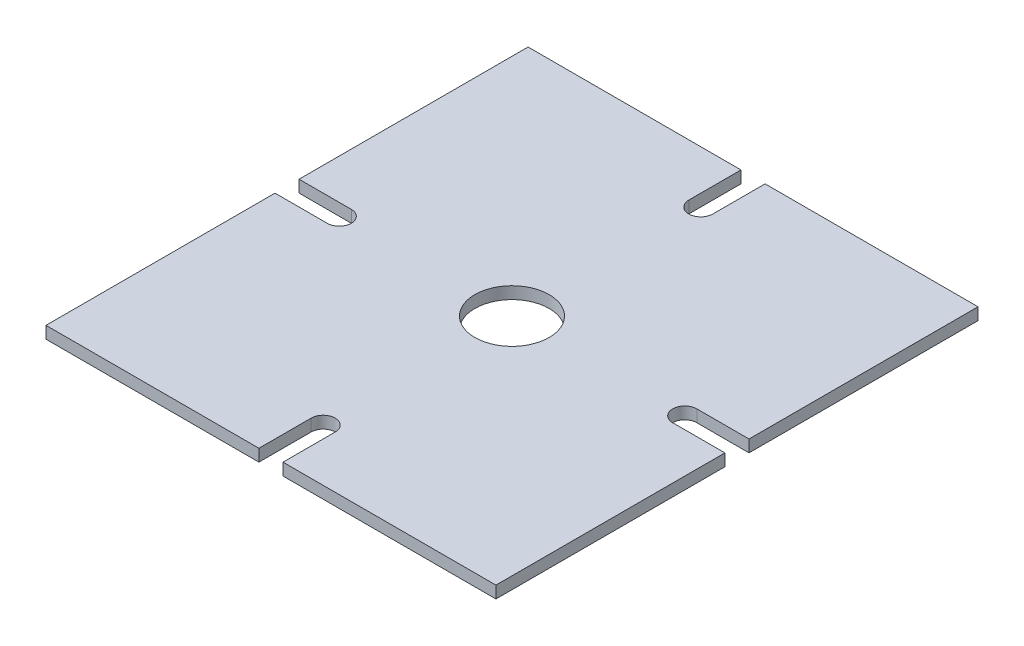
ISO-10303-21;
HEADER;
FILE_DESCRIPTION(('STEP AP214'),'2;1');
FILE_NAME('part.step','',(''),(''),'','','');
FILE_SCHEMA(('AUTOMOTIVE_DESIGN { 1 0 10303 214 1 1 1 1 }'));
ENDSEC;
DATA;
#1=APPLICATION_CONTEXT('core data for automotive mechanical design processes');
#2=APPLICATION_PROTOCOL_DEFINITION('international standard','automotive_design',2000,#1);
#3=PRODUCT_CONTEXT('',#1,'mechanical');
#4=PRODUCT('Part','Part','',(#3));
#5=PRODUCT_RELATED_PRODUCT_CATEGORY('part','',(#4));
#6=PRODUCT_DEFINITION_FORMATION('','',#4);
#7=PRODUCT_DEFINITION_CONTEXT('part definition',#1,'design');
#8=PRODUCT_DEFINITION('design','',#6,#7);
#9=PRODUCT_DEFINITION_SHAPE('','',#8);
#10=(LENGTH_UNIT() NAMED_UNIT(*) SI_UNIT(.MILLI.,.METRE.));
#11=(NAMED_UNIT(*) PLANE_ANGLE_UNIT() SI_UNIT($,.RADIAN.));
#12=(NAMED_UNIT(*) SI_UNIT($,.STERADIAN.) SOLID_ANGLE_UNIT());
#13=UNCERTAINTY_MEASURE_WITH_UNIT(LENGTH_MEASURE(1.E-05),#10,'distance_accuracy_value','');
#14=(GEOMETRIC_REPRESENTATION_CONTEXT(3) GLOBAL_UNCERTAINTY_ASSIGNED_CONTEXT((#13)) GLOBAL_UNIT_ASSIGNED_CONTEXT((#10,
#11,#12)) REPRESENTATION_CONTEXT('',''));
#15=CARTESIAN_POINT('',(0.,0.,0.));
#16=DIRECTION('',(0.,0.,1.));
#17=DIRECTION('',(1.,0.,0.));
#18=AXIS2_PLACEMENT_3D('',#15,#16,#17);
#19=CARTESIAN_POINT('',(56.,3.,60.));
#20=DIRECTION('',(-1.,0.,0.));
#21=DIRECTION('',(0.,0.,1.));
#22=AXIS2_PLACEMENT_3D('',#19,#20,#21);
#23=PLANE('',#22);
#24=DIRECTION('',(0.,0.,-1.));
#25=VECTOR('',#24,1.);
#26=CARTESIAN_POINT('',(56.,0.,60.));
#27=LINE('',#26,#25);
#28=CARTESIAN_POINT('',(56.,0.,60.));
#29=VERTEX_POINT('',#28);
#30=CARTESIAN_POINT('',(56.,0.,3.));
#31=VERTEX_POINT('',#30);
#32=EDGE_CURVE('E271',#29,#31,#27,.T.);
#33=ORIENTED_EDGE('',*,*,#32,.T.);
#34=DIRECTION('',(0.,1.,0.));
#35=VECTOR('',#34,1.);
#36=CARTESIAN_POINT('',(56.,-7.,3.));
#37=LINE('',#36,#35);
#38=CARTESIAN_POINT('',(56.,3.,3.));
#39=VERTEX_POINT('',#38);
#40=EDGE_CURVE('E228',#31,#39,#37,.T.);
#41=ORIENTED_EDGE('',*,*,#40,.T.);
#42=DIRECTION('',(0.,0.,-1.));
#43=VECTOR('',#42,1.);
#44=CARTESIAN_POINT('',(56.,3.,60.));
#45=LINE('',#44,#43);
#46=CARTESIAN_POINT('',(56.,3.,60.));
#47=VERTEX_POINT('',#46);
#48=EDGE_CURVE('E256',#47,#39,#45,.T.);
#49=ORIENTED_EDGE('',*,*,#48,.F.);
#50=DIRECTION('',(0.,-1.,0.));
#51=VECTOR('',#50,1.);
#52=CARTESIAN_POINT('',(56.,3.,60.));
#53=LINE('',#52,#51);
#54=EDGE_CURVE('E270',#47,#29,#53,.T.);
#55=ORIENTED_EDGE('',*,*,#54,.T.);
#56=EDGE_LOOP('',(#33,#41,#49,#55));
#57=FACE_BOUND('',#56,.T.);
#58=ADVANCED_FACE('F37',(#57),#23,.F.);
#59=CARTESIAN_POINT('',(-56.,3.,-60.));
#60=DIRECTION('',(0.,0.,1.));
#61=DIRECTION('',(1.,0.,0.));
#62=AXIS2_PLACEMENT_3D('',#59,#60,#61);
#63=PLANE('',#62);
#64=DIRECTION('',(-1.,0.,0.));
#65=VECTOR('',#64,1.);
#66=CARTESIAN_POINT('',(-56.,3.,-60.));
#67=LINE('',#66,#65);
#68=CARTESIAN_POINT('',(-3.,3.,-60.));
#69=VERTEX_POINT('',#68);
#70=CARTESIAN_POINT('',(-56.,3.,-60.));
#71=VERTEX_POINT('',#70);
#72=EDGE_CURVE('E259',#69,#71,#67,.T.);
#73=ORIENTED_EDGE('',*,*,#72,.F.);
#74=DIRECTION('',(0.,1.,0.));
#75=VECTOR('',#74,1.);
#76=CARTESIAN_POINT('',(-3.,-7.,-60.));
#77=LINE('',#76,#75);
#78=CARTESIAN_POINT('',(-3.,0.,-60.));
#79=VERTEX_POINT('',#78);
#80=EDGE_CURVE('E211',#79,#69,#77,.T.);
#81=ORIENTED_EDGE('',*,*,#80,.F.);
#82=DIRECTION('',(-1.,0.,0.));
#83=VECTOR('',#82,1.);
#84=CARTESIAN_POINT('',(-56.,0.,-60.));
#85=LINE('',#84,#83);
#86=CARTESIAN_POINT('',(-56.,0.,-60.));
#87=VERTEX_POINT('',#86);
#88=EDGE_CURVE('E274',#79,#87,#85,.T.);
#89=ORIENTED_EDGE('',*,*,#88,.T.);
#90=DIRECTION('',(0.,-1.,0.));
#91=VECTOR('',#90,1.);
#92=CARTESIAN_POINT('',(-56.,3.,-60.));
#93=LINE('',#92,#91);
#94=EDGE_CURVE('E292',#71,#87,#93,.T.);
#95=ORIENTED_EDGE('',*,*,#94,.F.);
#96=EDGE_LOOP('',(#73,#81,#89,#95));
#97=FACE_BOUND('',#96,.T.);
#98=ADVANCED_FACE('F370',(#97),#63,.F.);
#99=CARTESIAN_POINT('',(-56.,3.,60.));
#100=DIRECTION('',(1.,0.,0.));
#101=DIRECTION('',(0.,0.,-1.));
#102=AXIS2_PLACEMENT_3D('',#99,#100,#101);
#103=PLANE('',#102);
#104=DIRECTION('',(0.,0.,1.));
#105=VECTOR('',#104,1.);
#106=CARTESIAN_POINT('',(-56.,3.,60.));
#107=LINE('',#106,#105);
#108=CARTESIAN_POINT('',(-56.,3.,3.));
#109=VERTEX_POINT('',#108);
#110=CARTESIAN_POINT('',(-56.,3.,60.));
#111=VERTEX_POINT('',#110);
#112=EDGE_CURVE('E264',#109,#111,#107,.T.);
#113=ORIENTED_EDGE('',*,*,#112,.F.);
#114=DIRECTION('',(0.,1.,0.));
#115=VECTOR('',#114,1.);
#116=CARTESIAN_POINT('',(-56.,-7.,3.));
#117=LINE('',#116,#115);
#118=CARTESIAN_POINT('',(-56.,0.,3.));
#119=VERTEX_POINT('',#118);
#120=EDGE_CURVE('E243',#119,#109,#117,.T.);
#121=ORIENTED_EDGE('',*,*,#120,.F.);
#122=DIRECTION('',(0.,0.,1.));
#123=VECTOR('',#122,1.);
#124=CARTESIAN_POINT('',(-56.,0.,60.));
#125=LINE('',#124,#123);
#126=CARTESIAN_POINT('',(-56.,0.,60.));
#127=VERTEX_POINT('',#126);
#128=EDGE_CURVE('E279',#119,#127,#125,.T.);
#129=ORIENTED_EDGE('',*,*,#128,.T.);
#130=DIRECTION('',(0.,-1.,0.));
#131=VECTOR('',#130,1.);
#132=CARTESIAN_POINT('',(-56.,3.,60.));
#133=LINE('',#132,#131);
#134=EDGE_CURVE('E289',#111,#127,#133,.T.);
#135=ORIENTED_EDGE('',*,*,#134,.F.);
#136=EDGE_LOOP('',(#113,#121,#129,#135));
#137=FACE_BOUND('',#136,.T.);
#138=ADVANCED_FACE('F394',(#137),#103,.F.);
#139=CARTESIAN_POINT('',(-56.,3.,60.));
#140=DIRECTION('',(0.,0.,-1.));
#141=DIRECTION('',(-1.,0.,0.));
#142=AXIS2_PLACEMENT_3D('',#139,#140,#141);
#143=PLANE('',#142);
#144=DIRECTION('',(1.,0.,0.));
#145=VECTOR('',#144,1.);
#146=CARTESIAN_POINT('',(-56.,3.,60.));
#147=LINE('',#146,#145);
#148=CARTESIAN_POINT('',(3.00000000000004,3.,60.));
#149=VERTEX_POINT('',#148);
#150=EDGE_CURVE('E268',#149,#47,#147,.T.);
#151=ORIENTED_EDGE('',*,*,#150,.F.);
#152=DIRECTION('',(0.,1.,0.));
#153=VECTOR('',#152,1.);
#154=CARTESIAN_POINT('',(3.00000000000004,-7.,60.));
#155=LINE('',#154,#153);
#156=CARTESIAN_POINT('',(3.00000000000004,0.,60.));
#157=VERTEX_POINT('',#156);
#158=EDGE_CURVE('E204',#157,#149,#155,.T.);
#159=ORIENTED_EDGE('',*,*,#158,.F.);
#160=DIRECTION('',(1.,0.,0.));
#161=VECTOR('',#160,1.);
#162=CARTESIAN_POINT('',(-56.,0.,60.));
#163=LINE('',#162,#161);
#164=EDGE_CURVE('E283',#157,#29,#163,.T.);
#165=ORIENTED_EDGE('',*,*,#164,.T.);
#166=ORIENTED_EDGE('',*,*,#54,.F.);
#167=EDGE_LOOP('',(#151,#159,#165,#166));
#168=FACE_BOUND('',#167,.T.);
#169=ADVANCED_FACE('F331',(#168),#143,.F.);
#170=CARTESIAN_POINT('',(56.,3.,-3.));
#171=VERTEX_POINT('',#170);
#172=CARTESIAN_POINT('',(56.,3.,-60.));
#173=VERTEX_POINT('',#172);
#174=EDGE_CURVE('E260',#171,#173,#45,.T.);
#175=ORIENTED_EDGE('',*,*,#174,.F.);
#176=DIRECTION('',(0.,1.,0.));
#177=VECTOR('',#176,1.);
#178=CARTESIAN_POINT('',(56.,-7.,-3.));
#179=LINE('',#178,#177);
#180=CARTESIAN_POINT('',(56.,0.,-3.));
#181=VERTEX_POINT('',#180);
#182=EDGE_CURVE('E222',#181,#171,#179,.T.);
#183=ORIENTED_EDGE('',*,*,#182,.F.);
#184=CARTESIAN_POINT('',(56.,0.,-60.));
#185=VERTEX_POINT('',#184);
#186=EDGE_CURVE('E275',#181,#185,#27,.T.);
#187=ORIENTED_EDGE('',*,*,#186,.T.);
#188=DIRECTION('',(0.,-1.,0.));
#189=VECTOR('',#188,1.);
#190=CARTESIAN_POINT('',(56.,3.,-60.));
#191=LINE('',#190,#189);
#192=EDGE_CURVE('E295',#173,#185,#191,.T.);
#193=ORIENTED_EDGE('',*,*,#192,.F.);
#194=EDGE_LOOP('',(#175,#183,#187,#193));
#195=FACE_BOUND('',#194,.T.);
#196=ADVANCED_FACE('F39',(#195),#23,.F.);
#197=CARTESIAN_POINT('',(3.00000000000002,0.,-60.));
#198=VERTEX_POINT('',#197);
#199=EDGE_CURVE('E276',#185,#198,#85,.T.);
#200=ORIENTED_EDGE('',*,*,#199,.T.);
#201=DIRECTION('',(0.,1.,0.));
#202=VECTOR('',#201,1.);
#203=CARTESIAN_POINT('',(3.00000000000004,-7.,-60.));
#204=LINE('',#203,#202);
#205=CARTESIAN_POINT('',(3.00000000000004,3.,-60.));
#206=VERTEX_POINT('',#205);
#207=EDGE_CURVE('E60',#198,#206,#204,.T.);
#208=ORIENTED_EDGE('',*,*,#207,.T.);
#209=EDGE_CURVE('E261',#173,#206,#67,.T.);
#210=ORIENTED_EDGE('',*,*,#209,.F.);
#211=ORIENTED_EDGE('',*,*,#192,.T.);
#212=EDGE_LOOP('',(#200,#208,#210,#211));
#213=FACE_BOUND('',#212,.T.);
#214=ADVANCED_FACE('F353',(#213),#63,.F.);
#215=CARTESIAN_POINT('',(-56.,0.,-3.));
#216=VERTEX_POINT('',#215);
#217=EDGE_CURVE('E280',#87,#216,#125,.T.);
#218=ORIENTED_EDGE('',*,*,#217,.T.);
#219=DIRECTION('',(0.,1.,0.));
#220=VECTOR('',#219,1.);
#221=CARTESIAN_POINT('',(-56.,-7.,-3.));
#222=LINE('',#221,#220);
#223=CARTESIAN_POINT('',(-56.,3.,-3.));
#224=VERTEX_POINT('',#223);
#225=EDGE_CURVE('E240',#216,#224,#222,.T.);
#226=ORIENTED_EDGE('',*,*,#225,.T.);
#227=EDGE_CURVE('E265',#71,#224,#107,.T.);
#228=ORIENTED_EDGE('',*,*,#227,.F.);
#229=ORIENTED_EDGE('',*,*,#94,.T.);
#230=EDGE_LOOP('',(#218,#226,#228,#229));
#231=FACE_BOUND('',#230,.T.);
#232=ADVANCED_FACE('F375',(#231),#103,.F.);
#233=CARTESIAN_POINT('',(-3.,0.,60.));
#234=VERTEX_POINT('',#233);
#235=EDGE_CURVE('E284',#127,#234,#163,.T.);
#236=ORIENTED_EDGE('',*,*,#235,.T.);
#237=DIRECTION('',(0.,1.,0.));
#238=VECTOR('',#237,1.);
#239=CARTESIAN_POINT('',(-3.,-7.,60.));
#240=LINE('',#239,#238);
#241=CARTESIAN_POINT('',(-3.,3.,60.));
#242=VERTEX_POINT('',#241);
#243=EDGE_CURVE('E182',#234,#242,#240,.T.);
#244=ORIENTED_EDGE('',*,*,#243,.T.);
#245=EDGE_CURVE('E198',#111,#242,#147,.T.);
#246=ORIENTED_EDGE('',*,*,#245,.F.);
#247=ORIENTED_EDGE('',*,*,#134,.T.);
#248=EDGE_LOOP('',(#236,#244,#246,#247));
#249=FACE_BOUND('',#248,.T.);
#250=ADVANCED_FACE('F398',(#249),#143,.F.);
#251=CARTESIAN_POINT('',(0.,3.,0.));
#252=DIRECTION('',(0.,-1.,0.));
#253=DIRECTION('',(0.,0.,-1.));
#254=AXIS2_PLACEMENT_3D('',#251,#252,#253);
#255=PLANE('',#254);
#256=CARTESIAN_POINT('',(0.,3.,0.));
#257=DIRECTION('',(0.,1.,0.));
#258=DIRECTION('',(0.,0.,1.));
#259=AXIS2_PLACEMENT_3D('',#256,#257,#258);
#260=CIRCLE('',#259,9.25);
#261=CARTESIAN_POINT('',(0.,3.,9.25));
#262=VERTEX_POINT('',#261);
#263=EDGE_CURVE('E203',#262,#262,#260,.T.);
#264=ORIENTED_EDGE('',*,*,#263,.F.);
#265=EDGE_LOOP('',(#264));
#266=FACE_BOUND('',#265,.T.);
#267=CARTESIAN_POINT('',(0.,3.,47.));
#268=DIRECTION('',(0.,1.,0.));
#269=DIRECTION('',(0.,0.,-1.));
#270=AXIS2_PLACEMENT_3D('',#267,#268,#269);
#271=CIRCLE('',#270,3.00000000000001);
#272=CARTESIAN_POINT('',(3.00000000000001,3.,47.));
#273=VERTEX_POINT('',#272);
#274=CARTESIAN_POINT('',(-3.,3.,47.));
#275=VERTEX_POINT('',#274);
#276=EDGE_CURVE('E186',#273,#275,#271,.T.);
#277=ORIENTED_EDGE('',*,*,#276,.F.);
#278=DIRECTION('',(0.,0.,-1.));
#279=VECTOR('',#278,1.);
#280=CARTESIAN_POINT('',(3.00000000000001,3.,47.));
#281=LINE('',#280,#279);
#282=EDGE_CURVE('E183',#149,#273,#281,.T.);
#283=ORIENTED_EDGE('',*,*,#282,.F.);
#284=ORIENTED_EDGE('',*,*,#150,.T.);
#285=ORIENTED_EDGE('',*,*,#48,.T.);
#286=DIRECTION('',(1.,0.,0.));
#287=VECTOR('',#286,1.);
#288=CARTESIAN_POINT('',(43.,3.,3.));
#289=LINE('',#288,#287);
#290=CARTESIAN_POINT('',(43.,3.,3.));
#291=VERTEX_POINT('',#290);
#292=EDGE_CURVE('E224',#291,#39,#289,.T.);
#293=ORIENTED_EDGE('',*,*,#292,.F.);
#294=CARTESIAN_POINT('',(43.,3.,0.));
#295=DIRECTION('',(0.,1.,0.));
#296=DIRECTION('',(0.,0.,1.));
#297=AXIS2_PLACEMENT_3D('',#294,#295,#296);
#298=CIRCLE('',#297,3.);
#299=CARTESIAN_POINT('',(43.,3.,-3.));
#300=VERTEX_POINT('',#299);
#301=EDGE_CURVE('E233',#300,#291,#298,.T.);
#302=ORIENTED_EDGE('',*,*,#301,.F.);
#303=DIRECTION('',(-1.,0.,0.));
#304=VECTOR('',#303,1.);
#305=CARTESIAN_POINT('',(56.,3.,-3.));
#306=LINE('',#305,#304);
#307=EDGE_CURVE('E215',#171,#300,#306,.T.);
#308=ORIENTED_EDGE('',*,*,#307,.F.);
#309=ORIENTED_EDGE('',*,*,#174,.T.);
#310=ORIENTED_EDGE('',*,*,#209,.T.);
#311=DIRECTION('',(0.,0.,-1.));
#312=VECTOR('',#311,1.);
#313=CARTESIAN_POINT('',(3.00000000000001,3.,-47.));
#314=LINE('',#313,#312);
#315=CARTESIAN_POINT('',(3.00000000000001,3.,-47.));
#316=VERTEX_POINT('',#315);
#317=EDGE_CURVE('E218',#316,#206,#314,.T.);
#318=ORIENTED_EDGE('',*,*,#317,.F.);
#319=CARTESIAN_POINT('',(0.,3.,-47.));
#320=DIRECTION('',(0.,1.,0.));
#321=DIRECTION('',(0.,0.,1.));
#322=AXIS2_PLACEMENT_3D('',#319,#320,#321);
#323=CIRCLE('',#322,3.00000000000001);
#324=CARTESIAN_POINT('',(-3.,3.,-47.));
#325=VERTEX_POINT('',#324);
#326=EDGE_CURVE('E193',#325,#316,#323,.T.);
#327=ORIENTED_EDGE('',*,*,#326,.F.);
#328=DIRECTION('',(0.,0.,1.));
#329=VECTOR('',#328,1.);
#330=CARTESIAN_POINT('',(-3.,3.,-60.));
#331=LINE('',#330,#329);
#332=EDGE_CURVE('E209',#69,#325,#331,.T.);
#333=ORIENTED_EDGE('',*,*,#332,.F.);
#334=ORIENTED_EDGE('',*,*,#72,.T.);
#335=ORIENTED_EDGE('',*,*,#227,.T.);
#336=DIRECTION('',(-1.,0.,0.));
#337=VECTOR('',#336,1.);
#338=CARTESIAN_POINT('',(-56.,3.,-3.));
#339=LINE('',#338,#337);
#340=CARTESIAN_POINT('',(-43.,3.,-3.));
#341=VERTEX_POINT('',#340);
#342=EDGE_CURVE('E249',#341,#224,#339,.T.);
#343=ORIENTED_EDGE('',*,*,#342,.F.);
#344=CARTESIAN_POINT('',(-43.,3.,0.));
#345=DIRECTION('',(0.,1.,0.));
#346=DIRECTION('',(0.,0.,-1.));
#347=AXIS2_PLACEMENT_3D('',#344,#345,#346);
#348=CIRCLE('',#347,3.);
#349=CARTESIAN_POINT('',(-43.,3.,3.));
#350=VERTEX_POINT('',#349);
#351=EDGE_CURVE('E231',#350,#341,#348,.T.);
#352=ORIENTED_EDGE('',*,*,#351,.F.);
#353=DIRECTION('',(1.,0.,0.));
#354=VECTOR('',#353,1.);
#355=CARTESIAN_POINT('',(-43.,3.,3.));
#356=LINE('',#355,#354);
#357=EDGE_CURVE('E239',#109,#350,#356,.T.);
#358=ORIENTED_EDGE('',*,*,#357,.F.);
#359=ORIENTED_EDGE('',*,*,#112,.T.);
#360=ORIENTED_EDGE('',*,*,#245,.T.);
#361=DIRECTION('',(0.,0.,1.));
#362=VECTOR('',#361,1.);
#363=CARTESIAN_POINT('',(-3.,3.,60.));
#364=LINE('',#363,#362);
#365=EDGE_CURVE('E176',#275,#242,#364,.T.);
#366=ORIENTED_EDGE('',*,*,#365,.F.);
#367=EDGE_LOOP('',(#277,#283,#284,#285,#293,#302,#308,#309,#310,#318,#327,#333,#334,#335,#343,
#352,#358,#359,#360,#366));
#368=FACE_BOUND('',#367,.T.);
#369=ADVANCED_FACE('F196',(#266,#368),#255,.F.);
#370=CARTESIAN_POINT('',(0.,0.,0.));
#371=DIRECTION('',(0.,-1.,0.));
#372=DIRECTION('',(0.,0.,-1.));
#373=AXIS2_PLACEMENT_3D('',#370,#371,#372);
#374=PLANE('',#373);
#375=DIRECTION('',(0.,0.,1.));
#376=VECTOR('',#375,1.);
#377=CARTESIAN_POINT('',(2.99999999999993,0.,0.));
#378=LINE('',#377,#376);
#379=CARTESIAN_POINT('',(3.00000000000001,0.,47.));
#380=VERTEX_POINT('',#379);
#381=EDGE_CURVE('E11',#380,#157,#378,.T.);
#382=ORIENTED_EDGE('',*,*,#381,.F.);
#383=CARTESIAN_POINT('',(0.,0.,47.));
#384=DIRECTION('',(0.,-1.,0.));
#385=DIRECTION('',(0.,0.,-1.));
#386=AXIS2_PLACEMENT_3D('',#383,#384,#385);
#387=CIRCLE('',#386,3.00000000000001);
#388=CARTESIAN_POINT('',(-3.,0.,47.));
#389=VERTEX_POINT('',#388);
#390=EDGE_CURVE('E45',#389,#380,#387,.T.);
#391=ORIENTED_EDGE('',*,*,#390,.F.);
#392=DIRECTION('',(0.,0.,-1.));
#393=VECTOR('',#392,1.);
#394=CARTESIAN_POINT('',(-3.,0.,0.));
#395=LINE('',#394,#393);
#396=EDGE_CURVE('E179',#234,#389,#395,.T.);
#397=ORIENTED_EDGE('',*,*,#396,.F.);
#398=ORIENTED_EDGE('',*,*,#235,.F.);
#399=ORIENTED_EDGE('',*,*,#128,.F.);
#400=DIRECTION('',(-1.,0.,0.));
#401=VECTOR('',#400,1.);
#402=CARTESIAN_POINT('',(0.,0.,3.));
#403=LINE('',#402,#401);
#404=CARTESIAN_POINT('',(-43.,0.,3.));
#405=VERTEX_POINT('',#404);
#406=EDGE_CURVE('E304',#405,#119,#403,.T.);
#407=ORIENTED_EDGE('',*,*,#406,.F.);
#408=CARTESIAN_POINT('',(-43.,0.,0.));
#409=DIRECTION('',(0.,-1.,0.));
#410=DIRECTION('',(0.,0.,-1.));
#411=AXIS2_PLACEMENT_3D('',#408,#409,#410);
#412=CIRCLE('',#411,3.);
#413=CARTESIAN_POINT('',(-43.,0.,-3.));
#414=VERTEX_POINT('',#413);
#415=EDGE_CURVE('E302',#414,#405,#412,.T.);
#416=ORIENTED_EDGE('',*,*,#415,.F.);
#417=DIRECTION('',(1.,0.,0.));
#418=VECTOR('',#417,1.);
#419=CARTESIAN_POINT('',(0.,0.,-2.99999999999999));
#420=LINE('',#419,#418);
#421=EDGE_CURVE('E298',#216,#414,#420,.T.);
#422=ORIENTED_EDGE('',*,*,#421,.F.);
#423=ORIENTED_EDGE('',*,*,#217,.F.);
#424=ORIENTED_EDGE('',*,*,#88,.F.);
#425=DIRECTION('',(0.,0.,-1.));
#426=VECTOR('',#425,1.);
#427=CARTESIAN_POINT('',(-3.,0.,0.));
#428=LINE('',#427,#426);
#429=CARTESIAN_POINT('',(-3.,0.,-47.));
#430=VERTEX_POINT('',#429);
#431=EDGE_CURVE('E316',#430,#79,#428,.T.);
#432=ORIENTED_EDGE('',*,*,#431,.F.);
#433=CARTESIAN_POINT('',(0.,0.,-47.));
#434=DIRECTION('',(0.,-1.,0.));
#435=DIRECTION('',(0.,0.,-1.));
#436=AXIS2_PLACEMENT_3D('',#433,#434,#435);
#437=CIRCLE('',#436,3.00000000000001);
#438=CARTESIAN_POINT('',(3.00000000000001,0.,-47.));
#439=VERTEX_POINT('',#438);
#440=EDGE_CURVE('E314',#439,#430,#437,.T.);
#441=ORIENTED_EDGE('',*,*,#440,.F.);
#442=DIRECTION('',(0.,0.,1.));
#443=VECTOR('',#442,1.);
#444=CARTESIAN_POINT('',(2.99999999999993,0.,0.));
#445=LINE('',#444,#443);
#446=EDGE_CURVE('E312',#198,#439,#445,.T.);
#447=ORIENTED_EDGE('',*,*,#446,.F.);
#448=ORIENTED_EDGE('',*,*,#199,.F.);
#449=ORIENTED_EDGE('',*,*,#186,.F.);
#450=DIRECTION('',(1.,0.,0.));
#451=VECTOR('',#450,1.);
#452=CARTESIAN_POINT('',(0.,0.,-2.99999999999999));
#453=LINE('',#452,#451);
#454=CARTESIAN_POINT('',(43.,0.,-3.));
#455=VERTEX_POINT('',#454);
#456=EDGE_CURVE('E306',#455,#181,#453,.T.);
#457=ORIENTED_EDGE('',*,*,#456,.F.);
#458=CARTESIAN_POINT('',(43.,0.,0.));
#459=DIRECTION('',(0.,-1.,0.));
#460=DIRECTION('',(0.,0.,-1.));
#461=AXIS2_PLACEMENT_3D('',#458,#459,#460);
#462=CIRCLE('',#461,3.);
#463=CARTESIAN_POINT('',(43.,0.,3.));
#464=VERTEX_POINT('',#463);
#465=EDGE_CURVE('E308',#464,#455,#462,.T.);
#466=ORIENTED_EDGE('',*,*,#465,.F.);
#467=DIRECTION('',(-1.,0.,0.));
#468=VECTOR('',#467,1.);
#469=CARTESIAN_POINT('',(0.,0.,3.));
#470=LINE('',#469,#468);
#471=EDGE_CURVE('E310',#31,#464,#470,.T.);
#472=ORIENTED_EDGE('',*,*,#471,.F.);
#473=ORIENTED_EDGE('',*,*,#32,.F.);
#474=ORIENTED_EDGE('',*,*,#164,.F.);
#475=EDGE_LOOP('',(#382,#391,#397,#398,#399,#407,#416,#422,#423,#424,#432,#441,#447,#448,#449,
#457,#466,#472,#473,#474));
#476=FACE_BOUND('',#475,.T.);
#477=CARTESIAN_POINT('',(0.,0.,0.));
#478=DIRECTION('',(0.,-1.,0.));
#479=DIRECTION('',(0.,0.,-1.));
#480=AXIS2_PLACEMENT_3D('',#477,#478,#479);
#481=CIRCLE('',#480,9.25);
#482=CARTESIAN_POINT('',(0.,0.,-9.25));
#483=VERTEX_POINT('',#482);
#484=EDGE_CURVE('E255',#483,#483,#481,.T.);
#485=ORIENTED_EDGE('',*,*,#484,.F.);
#486=EDGE_LOOP('',(#485));
#487=FACE_BOUND('',#486,.T.);
#488=ADVANCED_FACE('F324',(#476,#487),#374,.T.);
#489=CARTESIAN_POINT('',(0.,-7.,0.));
#490=DIRECTION('',(0.,1.,0.));
#491=DIRECTION('',(0.,0.,1.));
#492=AXIS2_PLACEMENT_3D('',#489,#490,#491);
#493=CYLINDRICAL_SURFACE('',#492,9.25);
#494=ORIENTED_EDGE('',*,*,#484,.T.);
#495=EDGE_LOOP('',(#494));
#496=FACE_BOUND('',#495,.T.);
#497=ORIENTED_EDGE('',*,*,#263,.T.);
#498=EDGE_LOOP('',(#497));
#499=FACE_BOUND('',#498,.T.);
#500=ADVANCED_FACE('F447',(#496,#499),#493,.F.);
#501=CARTESIAN_POINT('',(-43.,-7.,0.));
#502=DIRECTION('',(0.,1.,0.));
#503=DIRECTION('',(0.,0.,1.));
#504=AXIS2_PLACEMENT_3D('',#501,#502,#503);
#505=CYLINDRICAL_SURFACE('',#504,3.);
#506=ORIENTED_EDGE('',*,*,#415,.T.);
#507=DIRECTION('',(0.,1.,0.));
#508=VECTOR('',#507,1.);
#509=CARTESIAN_POINT('',(-43.,-7.,3.));
#510=LINE('',#509,#508);
#511=EDGE_CURVE('E245',#405,#350,#510,.T.);
#512=ORIENTED_EDGE('',*,*,#511,.T.);
#513=ORIENTED_EDGE('',*,*,#351,.T.);
#514=DIRECTION('',(0.,1.,0.));
#515=VECTOR('',#514,1.);
#516=CARTESIAN_POINT('',(-43.,-7.,-3.));
#517=LINE('',#516,#515);
#518=EDGE_CURVE('E237',#414,#341,#517,.T.);
#519=ORIENTED_EDGE('',*,*,#518,.F.);
#520=EDGE_LOOP('',(#506,#512,#513,#519));
#521=FACE_BOUND('',#520,.T.);
#522=ADVANCED_FACE('F385',(#521),#505,.F.);
#523=CARTESIAN_POINT('',(-43.,-7.,3.));
#524=DIRECTION('',(0.,0.,1.));
#525=DIRECTION('',(1.,0.,0.));
#526=AXIS2_PLACEMENT_3D('',#523,#524,#525);
#527=PLANE('',#526);
#528=ORIENTED_EDGE('',*,*,#406,.T.);
#529=ORIENTED_EDGE('',*,*,#120,.T.);
#530=ORIENTED_EDGE('',*,*,#357,.T.);
#531=ORIENTED_EDGE('',*,*,#511,.F.);
#532=EDGE_LOOP('',(#528,#529,#530,#531));
#533=FACE_BOUND('',#532,.T.);
#534=ADVANCED_FACE('F389',(#533),#527,.F.);
#535=CARTESIAN_POINT('',(-56.,-7.,-3.));
#536=DIRECTION('',(0.,0.,-1.));
#537=DIRECTION('',(-1.,0.,0.));
#538=AXIS2_PLACEMENT_3D('',#535,#536,#537);
#539=PLANE('',#538);
#540=ORIENTED_EDGE('',*,*,#421,.T.);
#541=ORIENTED_EDGE('',*,*,#518,.T.);
#542=ORIENTED_EDGE('',*,*,#342,.T.);
#543=ORIENTED_EDGE('',*,*,#225,.F.);
#544=EDGE_LOOP('',(#540,#541,#542,#543));
#545=FACE_BOUND('',#544,.T.);
#546=ADVANCED_FACE('F380',(#545),#539,.F.);
#547=CARTESIAN_POINT('',(43.,-7.,3.));
#548=DIRECTION('',(0.,0.,1.));
#549=DIRECTION('',(1.,0.,0.));
#550=AXIS2_PLACEMENT_3D('',#547,#548,#549);
#551=PLANE('',#550);
#552=ORIENTED_EDGE('',*,*,#471,.T.);
#553=DIRECTION('',(0.,1.,0.));
#554=VECTOR('',#553,1.);
#555=CARTESIAN_POINT('',(43.,-7.,3.));
#556=LINE('',#555,#554);
#557=EDGE_CURVE('E226',#464,#291,#556,.T.);
#558=ORIENTED_EDGE('',*,*,#557,.T.);
#559=ORIENTED_EDGE('',*,*,#292,.T.);
#560=ORIENTED_EDGE('',*,*,#40,.F.);
#561=EDGE_LOOP('',(#552,#558,#559,#560));
#562=FACE_BOUND('',#561,.T.);
#563=ADVANCED_FACE('F338',(#562),#551,.F.);
#564=CARTESIAN_POINT('',(43.,-7.,0.));
#565=DIRECTION('',(0.,1.,0.));
#566=DIRECTION('',(0.,0.,1.));
#567=AXIS2_PLACEMENT_3D('',#564,#565,#566);
#568=CYLINDRICAL_SURFACE('',#567,3.);
#569=ORIENTED_EDGE('',*,*,#465,.T.);
#570=DIRECTION('',(0.,1.,0.));
#571=VECTOR('',#570,1.);
#572=CARTESIAN_POINT('',(43.,-7.,-3.));
#573=LINE('',#572,#571);
#574=EDGE_CURVE('E52',#455,#300,#573,.T.);
#575=ORIENTED_EDGE('',*,*,#574,.T.);
#576=ORIENTED_EDGE('',*,*,#301,.T.);
#577=ORIENTED_EDGE('',*,*,#557,.F.);
#578=EDGE_LOOP('',(#569,#575,#576,#577));
#579=FACE_BOUND('',#578,.T.);
#580=ADVANCED_FACE('F342',(#579),#568,.F.);
#581=CARTESIAN_POINT('',(56.,-7.,-3.));
#582=DIRECTION('',(0.,0.,-1.));
#583=DIRECTION('',(-1.,0.,0.));
#584=AXIS2_PLACEMENT_3D('',#581,#582,#583);
#585=PLANE('',#584);
#586=ORIENTED_EDGE('',*,*,#456,.T.);
#587=ORIENTED_EDGE('',*,*,#182,.T.);
#588=ORIENTED_EDGE('',*,*,#307,.T.);
#589=ORIENTED_EDGE('',*,*,#574,.F.);
#590=EDGE_LOOP('',(#586,#587,#588,#589));
#591=FACE_BOUND('',#590,.T.);
#592=ADVANCED_FACE('F344',(#591),#585,.F.);
#593=CARTESIAN_POINT('',(0.,-7.,-47.));
#594=DIRECTION('',(0.,1.,0.));
#595=DIRECTION('',(0.,0.,1.));
#596=AXIS2_PLACEMENT_3D('',#593,#594,#595);
#597=CYLINDRICAL_SURFACE('',#596,3.00000000000001);
#598=ORIENTED_EDGE('',*,*,#440,.T.);
#599=DIRECTION('',(0.,1.,0.));
#600=VECTOR('',#599,1.);
#601=CARTESIAN_POINT('',(-3.,-7.,-47.));
#602=LINE('',#601,#600);
#603=EDGE_CURVE('E213',#430,#325,#602,.T.);
#604=ORIENTED_EDGE('',*,*,#603,.T.);
#605=ORIENTED_EDGE('',*,*,#326,.T.);
#606=DIRECTION('',(0.,1.,0.));
#607=VECTOR('',#606,1.);
#608=CARTESIAN_POINT('',(3.00000000000001,-7.,-47.));
#609=LINE('',#608,#607);
#610=EDGE_CURVE('E207',#439,#316,#609,.T.);
#611=ORIENTED_EDGE('',*,*,#610,.F.);
#612=EDGE_LOOP('',(#598,#604,#605,#611));
#613=FACE_BOUND('',#612,.T.);
#614=ADVANCED_FACE('F361',(#613),#597,.F.);
#615=CARTESIAN_POINT('',(-3.,-7.,-60.));
#616=DIRECTION('',(-1.,0.,0.));
#617=DIRECTION('',(0.,0.,1.));
#618=AXIS2_PLACEMENT_3D('',#615,#616,#617);
#619=PLANE('',#618);
#620=ORIENTED_EDGE('',*,*,#431,.T.);
#621=ORIENTED_EDGE('',*,*,#80,.T.);
#622=ORIENTED_EDGE('',*,*,#332,.T.);
#623=ORIENTED_EDGE('',*,*,#603,.F.);
#624=EDGE_LOOP('',(#620,#621,#622,#623));
#625=FACE_BOUND('',#624,.T.);
#626=ADVANCED_FACE('F365',(#625),#619,.F.);
#627=CARTESIAN_POINT('',(3.00000000000001,-7.,-47.));
#628=DIRECTION('',(1.,0.,0.));
#629=DIRECTION('',(0.,0.,-1.));
#630=AXIS2_PLACEMENT_3D('',#627,#628,#629);
#631=PLANE('',#630);
#632=ORIENTED_EDGE('',*,*,#446,.T.);
#633=ORIENTED_EDGE('',*,*,#610,.T.);
#634=ORIENTED_EDGE('',*,*,#317,.T.);
#635=ORIENTED_EDGE('',*,*,#207,.F.);
#636=EDGE_LOOP('',(#632,#633,#634,#635));
#637=FACE_BOUND('',#636,.T.);
#638=ADVANCED_FACE('F357',(#637),#631,.F.);
#639=CARTESIAN_POINT('',(0.,-7.,47.));
#640=DIRECTION('',(0.,1.,0.));
#641=DIRECTION('',(0.,0.,1.));
#642=AXIS2_PLACEMENT_3D('',#639,#640,#641);
#643=CYLINDRICAL_SURFACE('',#642,3.00000000000001);
#644=ORIENTED_EDGE('',*,*,#390,.T.);
#645=DIRECTION('',(0.,1.,0.));
#646=VECTOR('',#645,1.);
#647=CARTESIAN_POINT('',(3.00000000000001,-7.,47.));
#648=LINE('',#647,#646);
#649=EDGE_CURVE('E189',#380,#273,#648,.T.);
#650=ORIENTED_EDGE('',*,*,#649,.T.);
#651=ORIENTED_EDGE('',*,*,#276,.T.);
#652=DIRECTION('',(0.,1.,0.));
#653=VECTOR('',#652,1.);
#654=CARTESIAN_POINT('',(-3.,-7.,47.));
#655=LINE('',#654,#653);
#656=EDGE_CURVE('E172',#389,#275,#655,.T.);
#657=ORIENTED_EDGE('',*,*,#656,.F.);
#658=EDGE_LOOP('',(#644,#650,#651,#657));
#659=FACE_BOUND('',#658,.T.);
#660=ADVANCED_FACE('F187',(#659),#643,.F.);
#661=CARTESIAN_POINT('',(3.00000000000001,-7.,47.));
#662=DIRECTION('',(1.,0.,0.));
#663=DIRECTION('',(0.,0.,-1.));
#664=AXIS2_PLACEMENT_3D('',#661,#662,#663);
#665=PLANE('',#664);
#666=ORIENTED_EDGE('',*,*,#381,.T.);
#667=ORIENTED_EDGE('',*,*,#158,.T.);
#668=ORIENTED_EDGE('',*,*,#282,.T.);
#669=ORIENTED_EDGE('',*,*,#649,.F.);
#670=EDGE_LOOP('',(#666,#667,#668,#669));
#671=FACE_BOUND('',#670,.T.);
#672=ADVANCED_FACE('F321',(#671),#665,.F.);
#673=CARTESIAN_POINT('',(-3.,-7.,60.));
#674=DIRECTION('',(-1.,0.,0.));
#675=DIRECTION('',(0.,0.,1.));
#676=AXIS2_PLACEMENT_3D('',#673,#674,#675);
#677=PLANE('',#676);
#678=ORIENTED_EDGE('',*,*,#396,.T.);
#679=ORIENTED_EDGE('',*,*,#656,.T.);
#680=ORIENTED_EDGE('',*,*,#365,.T.);
#681=ORIENTED_EDGE('',*,*,#243,.F.);
#682=EDGE_LOOP('',(#678,#679,#680,#681));
#683=FACE_BOUND('',#682,.T.);
#684=ADVANCED_FACE('F174',(#683),#677,.F.);
#685=CLOSED_SHELL('',(#58,#98,#138,#169,#196,#214,#232,#250,#369,#488,#500,#522,#534,#546,#563,
#580,#592,#614,#626,#638,#660,#672,#684));
#686=MANIFOLD_SOLID_BREP('B2',#685);
#687=ADVANCED_BREP_SHAPE_REPRESENTATION('',(#18,#686),#14);
#688=SHAPE_DEFINITION_REPRESENTATION(#9,#687);
ENDSEC;
END-ISO-10303-21;
